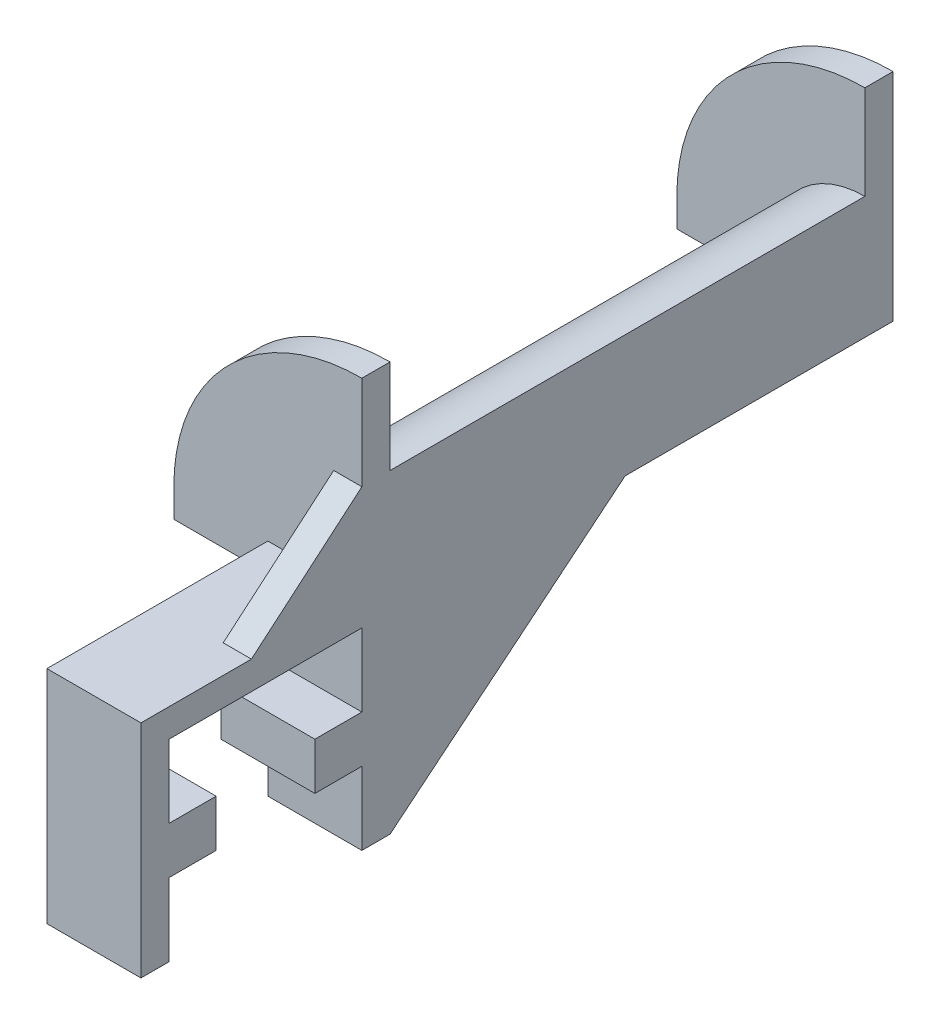
ISO-10303-21;
HEADER;
FILE_DESCRIPTION(('STEP AP214'),'2;1');
FILE_NAME('part.step','',(''),(''),'','','');
FILE_SCHEMA(('AUTOMOTIVE_DESIGN { 1 0 10303 214 1 1 1 1 }'));
ENDSEC;
DATA;
#1=APPLICATION_CONTEXT('core data for automotive mechanical design processes');
#2=APPLICATION_PROTOCOL_DEFINITION('international standard','automotive_design',2000,#1);
#3=PRODUCT_CONTEXT('',#1,'mechanical');
#4=PRODUCT('Part','Part','',(#3));
#5=PRODUCT_RELATED_PRODUCT_CATEGORY('part','',(#4));
#6=PRODUCT_DEFINITION_FORMATION('','',#4);
#7=PRODUCT_DEFINITION_CONTEXT('part definition',#1,'design');
#8=PRODUCT_DEFINITION('design','',#6,#7);
#9=PRODUCT_DEFINITION_SHAPE('','',#8);
#10=(LENGTH_UNIT() NAMED_UNIT(*) SI_UNIT(.MILLI.,.METRE.));
#11=(NAMED_UNIT(*) PLANE_ANGLE_UNIT() SI_UNIT($,.RADIAN.));
#12=(NAMED_UNIT(*) SI_UNIT($,.STERADIAN.) SOLID_ANGLE_UNIT());
#13=UNCERTAINTY_MEASURE_WITH_UNIT(LENGTH_MEASURE(1.E-05),#10,'distance_accuracy_value','');
#14=(GEOMETRIC_REPRESENTATION_CONTEXT(3) GLOBAL_UNCERTAINTY_ASSIGNED_CONTEXT((#13)) GLOBAL_UNIT_ASSIGNED_CONTEXT((#10,
#11,#12)) REPRESENTATION_CONTEXT('',''));
#15=CARTESIAN_POINT('',(0.,0.,0.));
#16=DIRECTION('',(0.,0.,1.));
#17=DIRECTION('',(1.,0.,0.));
#18=AXIS2_PLACEMENT_3D('',#15,#16,#17);
#19=CARTESIAN_POINT('',(10.,-3.,-23.5));
#20=DIRECTION('',(0.,0.,-1.));
#21=DIRECTION('',(0.,1.,0.));
#22=AXIS2_PLACEMENT_3D('',#19,#20,#21);
#23=PLANE('',#22);
#24=DIRECTION('',(0.,-1.,0.));
#25=VECTOR('',#24,1.);
#26=CARTESIAN_POINT('',(10.,-3.,-23.5));
#27=LINE('',#26,#25);
#28=CARTESIAN_POINT('',(10.,-15.75,-23.5));
#29=VERTEX_POINT('',#28);
#30=CARTESIAN_POINT('',(10.,-23.5,-23.5));
#31=VERTEX_POINT('',#30);
#32=EDGE_CURVE('E254',#29,#31,#27,.T.);
#33=ORIENTED_EDGE('',*,*,#32,.F.);
#34=DIRECTION('',(1.,0.,0.));
#35=VECTOR('',#34,1.);
#36=CARTESIAN_POINT('',(-7.07106781186548,-15.75,-23.5));
#37=LINE('',#36,#35);
#38=CARTESIAN_POINT('',(0.,-15.75,-23.5));
#39=VERTEX_POINT('',#38);
#40=EDGE_CURVE('E468',#39,#29,#37,.T.);
#41=ORIENTED_EDGE('',*,*,#40,.F.);
#42=DIRECTION('',(0.,-1.,0.));
#43=VECTOR('',#42,1.);
#44=CARTESIAN_POINT('',(0.,-3.,-23.5));
#45=LINE('',#44,#43);
#46=CARTESIAN_POINT('',(0.,-23.5,-23.5));
#47=VERTEX_POINT('',#46);
#48=EDGE_CURVE('E281',#39,#47,#45,.T.);
#49=ORIENTED_EDGE('',*,*,#48,.T.);
#50=DIRECTION('',(-1.,0.,0.));
#51=VECTOR('',#50,1.);
#52=CARTESIAN_POINT('',(10.,-23.5,-23.5));
#53=LINE('',#52,#51);
#54=EDGE_CURVE('E299',#31,#47,#53,.T.);
#55=ORIENTED_EDGE('',*,*,#54,.F.);
#56=EDGE_LOOP('',(#33,#41,#49,#55));
#57=FACE_BOUND('',#56,.T.);
#58=ADVANCED_FACE('F33',(#57),#23,.F.);
#59=CARTESIAN_POINT('',(10.,-23.5,-3.));
#60=DIRECTION('',(0.,0.,1.));
#61=DIRECTION('',(0.,-1.,0.));
#62=AXIS2_PLACEMENT_3D('',#59,#60,#61);
#63=PLANE('',#62);
#64=DIRECTION('',(0.,1.,0.));
#65=VECTOR('',#64,1.);
#66=CARTESIAN_POINT('',(10.,-23.5,-3.));
#67=LINE('',#66,#65);
#68=CARTESIAN_POINT('',(10.,-10.75,-3.00000000000001));
#69=VERTEX_POINT('',#68);
#70=CARTESIAN_POINT('',(10.,-3.,-3.00000000000001));
#71=VERTEX_POINT('',#70);
#72=EDGE_CURVE('E336',#69,#71,#67,.T.);
#73=ORIENTED_EDGE('',*,*,#72,.F.);
#74=DIRECTION('',(1.,0.,0.));
#75=VECTOR('',#74,1.);
#76=CARTESIAN_POINT('',(-7.07106781186548,-10.75,-3.));
#77=LINE('',#76,#75);
#78=CARTESIAN_POINT('',(0.,-10.75,-3.));
#79=VERTEX_POINT('',#78);
#80=EDGE_CURVE('E452',#79,#69,#77,.T.);
#81=ORIENTED_EDGE('',*,*,#80,.F.);
#82=DIRECTION('',(0.,1.,0.));
#83=VECTOR('',#82,1.);
#84=CARTESIAN_POINT('',(0.,-23.5,-3.));
#85=LINE('',#84,#83);
#86=CARTESIAN_POINT('',(0.,-3.,-3.00000000000001));
#87=VERTEX_POINT('',#86);
#88=EDGE_CURVE('E274',#79,#87,#85,.T.);
#89=ORIENTED_EDGE('',*,*,#88,.T.);
#90=DIRECTION('',(-1.,0.,0.));
#91=VECTOR('',#90,1.);
#92=CARTESIAN_POINT('',(10.,-3.,-3.00000000000001));
#93=LINE('',#92,#91);
#94=EDGE_CURVE('E304',#71,#87,#93,.T.);
#95=ORIENTED_EDGE('',*,*,#94,.F.);
#96=EDGE_LOOP('',(#73,#81,#89,#95));
#97=FACE_BOUND('',#96,.T.);
#98=ADVANCED_FACE('F550',(#97),#63,.F.);
#99=CARTESIAN_POINT('',(0.,0.,0.));
#100=DIRECTION('',(1.,0.,0.));
#101=DIRECTION('',(0.,0.,-1.));
#102=AXIS2_PLACEMENT_3D('',#99,#100,#101);
#103=PLANE('',#102);
#104=DIRECTION('',(0.,0.,1.));
#105=VECTOR('',#104,1.);
#106=CARTESIAN_POINT('',(0.,-3.,0.));
#107=LINE('',#106,#105);
#108=CARTESIAN_POINT('',(0.,-3.,-26.5));
#109=VERTEX_POINT('',#108);
#110=CARTESIAN_POINT('',(0.,-3.,-23.5));
#111=VERTEX_POINT('',#110);
#112=EDGE_CURVE('E360',#109,#111,#107,.T.);
#113=ORIENTED_EDGE('',*,*,#112,.F.);
#114=DIRECTION('',(0.,1.,0.));
#115=VECTOR('',#114,1.);
#116=CARTESIAN_POINT('',(0.,-23.5,-26.5));
#117=LINE('',#116,#115);
#118=CARTESIAN_POINT('',(0.,-23.5,-26.5));
#119=VERTEX_POINT('',#118);
#120=EDGE_CURVE('E286',#119,#109,#117,.T.);
#121=ORIENTED_EDGE('',*,*,#120,.F.);
#122=DIRECTION('',(0.,0.,-1.));
#123=VECTOR('',#122,1.);
#124=CARTESIAN_POINT('',(0.,-23.5,-23.5));
#125=LINE('',#124,#123);
#126=EDGE_CURVE('E283',#47,#119,#125,.T.);
#127=ORIENTED_EDGE('',*,*,#126,.F.);
#128=ORIENTED_EDGE('',*,*,#48,.F.);
#129=DIRECTION('',(0.,0.,1.));
#130=VECTOR('',#129,1.);
#131=CARTESIAN_POINT('',(0.,-15.75,-23.5));
#132=LINE('',#131,#130);
#133=CARTESIAN_POINT('',(0.,-15.75,-18.5));
#134=VERTEX_POINT('',#133);
#135=EDGE_CURVE('E463',#39,#134,#132,.T.);
#136=ORIENTED_EDGE('',*,*,#135,.T.);
#137=DIRECTION('',(0.,1.,0.));
#138=VECTOR('',#137,1.);
#139=CARTESIAN_POINT('',(0.,-10.75,-18.5));
#140=LINE('',#139,#138);
#141=CARTESIAN_POINT('',(0.,-10.75,-18.5));
#142=VERTEX_POINT('',#141);
#143=EDGE_CURVE('E470',#134,#142,#140,.T.);
#144=ORIENTED_EDGE('',*,*,#143,.T.);
#145=DIRECTION('',(0.,0.,-1.));
#146=VECTOR('',#145,1.);
#147=CARTESIAN_POINT('',(0.,-10.75,-23.5));
#148=LINE('',#147,#146);
#149=CARTESIAN_POINT('',(0.,-10.75,-23.5));
#150=VERTEX_POINT('',#149);
#151=EDGE_CURVE('E460',#142,#150,#148,.T.);
#152=ORIENTED_EDGE('',*,*,#151,.T.);
#153=EDGE_CURVE('E246',#111,#150,#45,.T.);
#154=ORIENTED_EDGE('',*,*,#153,.F.);
#155=EDGE_LOOP('',(#113,#121,#127,#128,#136,#144,#152,#154));
#156=FACE_BOUND('',#155,.T.);
#157=ADVANCED_FACE('F477',(#156),#103,.F.);
#158=DIRECTION('',(0.,1.,0.));
#159=VECTOR('',#158,1.);
#160=CARTESIAN_POINT('',(0.,0.,-23.5));
#161=LINE('',#160,#159);
#162=CARTESIAN_POINT('',(0.,0.,-23.5));
#163=VERTEX_POINT('',#162);
#164=EDGE_CURVE('E376',#111,#163,#161,.T.);
#165=ORIENTED_EDGE('',*,*,#164,.F.);
#166=DIRECTION('',(0.,0.,-1.));
#167=VECTOR('',#166,1.);
#168=CARTESIAN_POINT('',(0.,-3.,-3.00000000000001));
#169=LINE('',#168,#167);
#170=EDGE_CURVE('E278',#87,#111,#169,.T.);
#171=ORIENTED_EDGE('',*,*,#170,.F.);
#172=ORIENTED_EDGE('',*,*,#88,.F.);
#173=DIRECTION('',(0.,0.,-1.));
#174=VECTOR('',#173,1.);
#175=CARTESIAN_POINT('',(0.,-10.75,-3.));
#176=LINE('',#175,#174);
#177=CARTESIAN_POINT('',(0.,-10.75,-8.));
#178=VERTEX_POINT('',#177);
#179=EDGE_CURVE('E446',#79,#178,#176,.T.);
#180=ORIENTED_EDGE('',*,*,#179,.T.);
#181=DIRECTION('',(0.,-1.,0.));
#182=VECTOR('',#181,1.);
#183=CARTESIAN_POINT('',(0.,-10.75,-8.));
#184=LINE('',#183,#182);
#185=CARTESIAN_POINT('',(0.,-15.75,-8.));
#186=VERTEX_POINT('',#185);
#187=EDGE_CURVE('E454',#178,#186,#184,.T.);
#188=ORIENTED_EDGE('',*,*,#187,.T.);
#189=DIRECTION('',(0.,0.,1.));
#190=VECTOR('',#189,1.);
#191=CARTESIAN_POINT('',(0.,-15.75,-3.));
#192=LINE('',#191,#190);
#193=CARTESIAN_POINT('',(0.,-15.75,-3.));
#194=VERTEX_POINT('',#193);
#195=EDGE_CURVE('E326',#186,#194,#192,.T.);
#196=ORIENTED_EDGE('',*,*,#195,.T.);
#197=CARTESIAN_POINT('',(0.,-23.5,-3.));
#198=VERTEX_POINT('',#197);
#199=EDGE_CURVE('E275',#198,#194,#85,.T.);
#200=ORIENTED_EDGE('',*,*,#199,.F.);
#201=DIRECTION('',(0.,0.,-1.));
#202=VECTOR('',#201,1.);
#203=CARTESIAN_POINT('',(0.,-23.5,0.));
#204=LINE('',#203,#202);
#205=CARTESIAN_POINT('',(0.,-23.5,0.));
#206=VERTEX_POINT('',#205);
#207=EDGE_CURVE('E272',#206,#198,#204,.T.);
#208=ORIENTED_EDGE('',*,*,#207,.F.);
#209=DIRECTION('',(0.,-1.,0.));
#210=VECTOR('',#209,1.);
#211=CARTESIAN_POINT('',(0.,0.,0.));
#212=LINE('',#211,#210);
#213=CARTESIAN_POINT('',(0.,0.,0.));
#214=VERTEX_POINT('',#213);
#215=EDGE_CURVE('E269',#214,#206,#212,.T.);
#216=ORIENTED_EDGE('',*,*,#215,.F.);
#217=DIRECTION('',(0.,0.,1.));
#218=VECTOR('',#217,1.);
#219=CARTESIAN_POINT('',(0.,0.,-80.));
#220=LINE('',#219,#218);
#221=EDGE_CURVE('E270',#163,#214,#220,.T.);
#222=ORIENTED_EDGE('',*,*,#221,.F.);
#223=EDGE_LOOP('',(#165,#171,#172,#180,#188,#196,#200,#208,#216,#222));
#224=FACE_BOUND('',#223,.T.);
#225=ADVANCED_FACE('F323',(#224),#103,.F.);
#226=DIRECTION('',(0.,0.,-1.));
#227=VECTOR('',#226,1.);
#228=CARTESIAN_POINT('',(0.,-3.,-26.5));
#229=LINE('',#228,#227);
#230=CARTESIAN_POINT('',(0.,-3.,-77.));
#231=VERTEX_POINT('',#230);
#232=EDGE_CURVE('E289',#109,#231,#229,.T.);
#233=ORIENTED_EDGE('',*,*,#232,.F.);
#234=DIRECTION('',(0.,1.,0.));
#235=VECTOR('',#234,1.);
#236=CARTESIAN_POINT('',(0.,0.,-26.5));
#237=LINE('',#236,#235);
#238=CARTESIAN_POINT('',(0.,0.,-26.5));
#239=VERTEX_POINT('',#238);
#240=EDGE_CURVE('E371',#109,#239,#237,.T.);
#241=ORIENTED_EDGE('',*,*,#240,.T.);
#242=CARTESIAN_POINT('',(0.,0.,-77.));
#243=VERTEX_POINT('',#242);
#244=EDGE_CURVE('E266',#243,#239,#220,.T.);
#245=ORIENTED_EDGE('',*,*,#244,.F.);
#246=DIRECTION('',(0.,1.,0.));
#247=VECTOR('',#246,1.);
#248=CARTESIAN_POINT('',(0.,0.,-77.));
#249=LINE('',#248,#247);
#250=EDGE_CURVE('E342',#231,#243,#249,.T.);
#251=ORIENTED_EDGE('',*,*,#250,.F.);
#252=EDGE_LOOP('',(#233,#241,#245,#251));
#253=FACE_BOUND('',#252,.T.);
#254=ADVANCED_FACE('F539',(#253),#103,.F.);
#255=CARTESIAN_POINT('',(10.,0.,14.142135623731));
#256=DIRECTION('',(0.,0.,-1.));
#257=DIRECTION('',(-1.,0.,0.));
#258=AXIS2_PLACEMENT_3D('',#255,#256,#257);
#259=CYLINDRICAL_SURFACE('',#258,10.);
#260=CARTESIAN_POINT('',(10.,0.,-26.5));
#261=DIRECTION('',(0.,0.,-1.));
#262=DIRECTION('',(0.,1.,0.));
#263=AXIS2_PLACEMENT_3D('',#260,#261,#262);
#264=CIRCLE('',#263,10.);
#265=CARTESIAN_POINT('',(10.,10.,-26.5));
#266=VERTEX_POINT('',#265);
#267=EDGE_CURVE('E374',#266,#239,#264,.F.);
#268=ORIENTED_EDGE('',*,*,#267,.F.);
#269=DIRECTION('',(0.,0.,-1.));
#270=VECTOR('',#269,1.);
#271=CARTESIAN_POINT('',(10.,10.,14.142135623731));
#272=LINE('',#271,#270);
#273=CARTESIAN_POINT('',(10.,10.,-77.));
#274=VERTEX_POINT('',#273);
#275=EDGE_CURVE('E340',#266,#274,#272,.T.);
#276=ORIENTED_EDGE('',*,*,#275,.T.);
#277=CARTESIAN_POINT('',(10.,0.,-77.));
#278=DIRECTION('',(0.,0.,-1.));
#279=DIRECTION('',(-1.,0.,0.));
#280=AXIS2_PLACEMENT_3D('',#277,#278,#279);
#281=CIRCLE('',#280,10.);
#282=EDGE_CURVE('E11',#274,#243,#281,.F.);
#283=ORIENTED_EDGE('',*,*,#282,.T.);
#284=ORIENTED_EDGE('',*,*,#244,.T.);
#285=EDGE_LOOP('',(#268,#276,#283,#284));
#286=FACE_BOUND('',#285,.T.);
#287=ADVANCED_FACE('F533',(#286),#259,.T.);
#288=CARTESIAN_POINT('',(10.,0.,0.));
#289=DIRECTION('',(0.,0.,-1.));
#290=DIRECTION('',(0.,1.,0.));
#291=AXIS2_PLACEMENT_3D('',#288,#289,#290);
#292=PLANE('',#291);
#293=DIRECTION('',(0.,-1.,0.));
#294=VECTOR('',#293,1.);
#295=CARTESIAN_POINT('',(10.,0.,0.));
#296=LINE('',#295,#294);
#297=CARTESIAN_POINT('',(10.,0.,0.));
#298=VERTEX_POINT('',#297);
#299=CARTESIAN_POINT('',(10.,-23.5,0.));
#300=VERTEX_POINT('',#299);
#301=EDGE_CURVE('E292',#298,#300,#296,.T.);
#302=ORIENTED_EDGE('',*,*,#301,.F.);
#303=DIRECTION('',(1.,0.,0.));
#304=VECTOR('',#303,1.);
#305=CARTESIAN_POINT('',(0.,0.,0.));
#306=LINE('',#305,#304);
#307=EDGE_CURVE('E425',#214,#298,#306,.T.);
#308=ORIENTED_EDGE('',*,*,#307,.F.);
#309=ORIENTED_EDGE('',*,*,#215,.T.);
#310=DIRECTION('',(-1.,0.,0.));
#311=VECTOR('',#310,1.);
#312=CARTESIAN_POINT('',(10.,-23.5,0.));
#313=LINE('',#312,#311);
#314=EDGE_CURVE('E41',#300,#206,#313,.T.);
#315=ORIENTED_EDGE('',*,*,#314,.F.);
#316=EDGE_LOOP('',(#302,#308,#309,#315));
#317=FACE_BOUND('',#316,.T.);
#318=ADVANCED_FACE('F35',(#317),#292,.F.);
#319=CARTESIAN_POINT('',(10.,-23.5,0.));
#320=DIRECTION('',(0.,1.,0.));
#321=DIRECTION('',(0.,0.,1.));
#322=AXIS2_PLACEMENT_3D('',#319,#320,#321);
#323=PLANE('',#322);
#324=ORIENTED_EDGE('',*,*,#207,.T.);
#325=DIRECTION('',(-1.,0.,0.));
#326=VECTOR('',#325,1.);
#327=CARTESIAN_POINT('',(10.,-23.5,-3.));
#328=LINE('',#327,#326);
#329=CARTESIAN_POINT('',(10.,-23.5,-3.));
#330=VERTEX_POINT('',#329);
#331=EDGE_CURVE('E307',#330,#198,#328,.T.);
#332=ORIENTED_EDGE('',*,*,#331,.F.);
#333=DIRECTION('',(0.,0.,-1.));
#334=VECTOR('',#333,1.);
#335=CARTESIAN_POINT('',(10.,-23.5,0.));
#336=LINE('',#335,#334);
#337=EDGE_CURVE('E316',#300,#330,#336,.T.);
#338=ORIENTED_EDGE('',*,*,#337,.F.);
#339=ORIENTED_EDGE('',*,*,#314,.T.);
#340=EDGE_LOOP('',(#324,#332,#338,#339));
#341=FACE_BOUND('',#340,.T.);
#342=ADVANCED_FACE('F314',(#341),#323,.F.);
#343=ORIENTED_EDGE('',*,*,#199,.T.);
#344=DIRECTION('',(1.,0.,0.));
#345=VECTOR('',#344,1.);
#346=CARTESIAN_POINT('',(-7.07106781186548,-15.75,-3.));
#347=LINE('',#346,#345);
#348=CARTESIAN_POINT('',(10.,-15.75,-3.));
#349=VERTEX_POINT('',#348);
#350=EDGE_CURVE('E332',#194,#349,#347,.T.);
#351=ORIENTED_EDGE('',*,*,#350,.T.);
#352=EDGE_CURVE('E334',#330,#349,#67,.T.);
#353=ORIENTED_EDGE('',*,*,#352,.F.);
#354=ORIENTED_EDGE('',*,*,#331,.T.);
#355=EDGE_LOOP('',(#343,#351,#353,#354));
#356=FACE_BOUND('',#355,.T.);
#357=ADVANCED_FACE('F330',(#356),#63,.F.);
#358=CARTESIAN_POINT('',(10.,-3.,-3.00000000000001));
#359=DIRECTION('',(0.,1.,0.));
#360=DIRECTION('',(0.,0.,1.));
#361=AXIS2_PLACEMENT_3D('',#358,#359,#360);
#362=PLANE('',#361);
#363=ORIENTED_EDGE('',*,*,#170,.T.);
#364=DIRECTION('',(-1.,0.,0.));
#365=VECTOR('',#364,1.);
#366=CARTESIAN_POINT('',(10.,-3.,-23.5));
#367=LINE('',#366,#365);
#368=CARTESIAN_POINT('',(10.,-3.,-23.5));
#369=VERTEX_POINT('',#368);
#370=EDGE_CURVE('E302',#369,#111,#367,.T.);
#371=ORIENTED_EDGE('',*,*,#370,.F.);
#372=DIRECTION('',(0.,0.,-1.));
#373=VECTOR('',#372,1.);
#374=CARTESIAN_POINT('',(10.,-3.,-3.00000000000001));
#375=LINE('',#374,#373);
#376=EDGE_CURVE('E251',#71,#369,#375,.T.);
#377=ORIENTED_EDGE('',*,*,#376,.F.);
#378=ORIENTED_EDGE('',*,*,#94,.T.);
#379=EDGE_LOOP('',(#363,#371,#377,#378));
#380=FACE_BOUND('',#379,.T.);
#381=ADVANCED_FACE('F561',(#380),#362,.F.);
#382=ORIENTED_EDGE('',*,*,#153,.T.);
#383=DIRECTION('',(1.,0.,0.));
#384=VECTOR('',#383,1.);
#385=CARTESIAN_POINT('',(-7.07106781186548,-10.75,-23.5));
#386=LINE('',#385,#384);
#387=CARTESIAN_POINT('',(10.,-10.75,-23.5));
#388=VERTEX_POINT('',#387);
#389=EDGE_CURVE('E232',#150,#388,#386,.T.);
#390=ORIENTED_EDGE('',*,*,#389,.T.);
#391=EDGE_CURVE('E244',#369,#388,#27,.T.);
#392=ORIENTED_EDGE('',*,*,#391,.F.);
#393=ORIENTED_EDGE('',*,*,#370,.T.);
#394=EDGE_LOOP('',(#382,#390,#392,#393));
#395=FACE_BOUND('',#394,.T.);
#396=ADVANCED_FACE('F242',(#395),#23,.F.);
#397=CARTESIAN_POINT('',(10.,-23.5,-23.5));
#398=DIRECTION('',(0.,1.,0.));
#399=DIRECTION('',(0.,0.,1.));
#400=AXIS2_PLACEMENT_3D('',#397,#398,#399);
#401=PLANE('',#400);
#402=ORIENTED_EDGE('',*,*,#126,.T.);
#403=DIRECTION('',(-1.,0.,0.));
#404=VECTOR('',#403,1.);
#405=CARTESIAN_POINT('',(10.,-23.5,-26.5));
#406=LINE('',#405,#404);
#407=CARTESIAN_POINT('',(7.,-23.5,-26.5));
#408=VERTEX_POINT('',#407);
#409=EDGE_CURVE('E296',#408,#119,#406,.T.);
#410=ORIENTED_EDGE('',*,*,#409,.F.);
#411=CARTESIAN_POINT('',(10.,-23.5,-26.5));
#412=VERTEX_POINT('',#411);
#413=EDGE_CURVE('E297',#412,#408,#406,.T.);
#414=ORIENTED_EDGE('',*,*,#413,.F.);
#415=DIRECTION('',(0.,0.,-1.));
#416=VECTOR('',#415,1.);
#417=CARTESIAN_POINT('',(10.,-23.5,-23.5));
#418=LINE('',#417,#416);
#419=EDGE_CURVE('E253',#31,#412,#418,.T.);
#420=ORIENTED_EDGE('',*,*,#419,.F.);
#421=ORIENTED_EDGE('',*,*,#54,.T.);
#422=EDGE_LOOP('',(#402,#410,#414,#420,#421));
#423=FACE_BOUND('',#422,.T.);
#424=ADVANCED_FACE('F492',(#423),#401,.F.);
#425=CARTESIAN_POINT('',(10.,-23.5,-26.5));
#426=DIRECTION('',(0.,0.,1.));
#427=DIRECTION('',(1.,0.,0.));
#428=AXIS2_PLACEMENT_3D('',#425,#426,#427);
#429=PLANE('',#428);
#430=DIRECTION('',(-1.,0.,0.));
#431=VECTOR('',#430,1.);
#432=CARTESIAN_POINT('',(10.,-3.,-26.5));
#433=LINE('',#432,#431);
#434=CARTESIAN_POINT('',(7.,-3.,-26.5));
#435=VERTEX_POINT('',#434);
#436=EDGE_CURVE('E294',#435,#109,#433,.T.);
#437=ORIENTED_EDGE('',*,*,#436,.F.);
#438=DIRECTION('',(0.,-1.,0.));
#439=VECTOR('',#438,1.);
#440=CARTESIAN_POINT('',(7.,-23.5,-26.5));
#441=LINE('',#440,#439);
#442=EDGE_CURVE('E409',#435,#408,#441,.T.);
#443=ORIENTED_EDGE('',*,*,#442,.T.);
#444=ORIENTED_EDGE('',*,*,#409,.T.);
#445=ORIENTED_EDGE('',*,*,#120,.T.);
#446=EDGE_LOOP('',(#437,#443,#444,#445));
#447=FACE_BOUND('',#446,.T.);
#448=ADVANCED_FACE('F501',(#447),#429,.F.);
#449=CARTESIAN_POINT('',(10.,-3.,-26.5));
#450=DIRECTION('',(0.,1.,0.));
#451=DIRECTION('',(0.,0.,1.));
#452=AXIS2_PLACEMENT_3D('',#449,#450,#451);
#453=PLANE('',#452);
#454=DIRECTION('',(0.,0.,-1.));
#455=VECTOR('',#454,1.);
#456=CARTESIAN_POINT('',(10.,-3.,-26.5));
#457=LINE('',#456,#455);
#458=CARTESIAN_POINT('',(10.,-3.,-51.5));
#459=VERTEX_POINT('',#458);
#460=CARTESIAN_POINT('',(10.,-3.,-80.));
#461=VERTEX_POINT('',#460);
#462=EDGE_CURVE('E257',#459,#461,#457,.T.);
#463=ORIENTED_EDGE('',*,*,#462,.F.);
#464=DIRECTION('',(1.,0.,0.));
#465=VECTOR('',#464,1.);
#466=CARTESIAN_POINT('',(7.,-3.,-51.5));
#467=LINE('',#466,#465);
#468=CARTESIAN_POINT('',(7.,-3.,-51.5));
#469=VERTEX_POINT('',#468);
#470=EDGE_CURVE('E399',#469,#459,#467,.T.);
#471=ORIENTED_EDGE('',*,*,#470,.F.);
#472=DIRECTION('',(0.,0.,1.));
#473=VECTOR('',#472,1.);
#474=CARTESIAN_POINT('',(7.,-3.,-26.5));
#475=LINE('',#474,#473);
#476=EDGE_CURVE('E416',#469,#435,#475,.T.);
#477=ORIENTED_EDGE('',*,*,#476,.T.);
#478=ORIENTED_EDGE('',*,*,#436,.T.);
#479=ORIENTED_EDGE('',*,*,#232,.T.);
#480=DIRECTION('',(-1.,0.,0.));
#481=VECTOR('',#480,1.);
#482=CARTESIAN_POINT('',(10.,-3.,-77.));
#483=LINE('',#482,#481);
#484=CARTESIAN_POINT('',(-10.,-3.,-77.));
#485=VERTEX_POINT('',#484);
#486=EDGE_CURVE('E356',#231,#485,#483,.T.);
#487=ORIENTED_EDGE('',*,*,#486,.T.);
#488=DIRECTION('',(0.,0.,-1.));
#489=VECTOR('',#488,1.);
#490=CARTESIAN_POINT('',(-10.,-3.,-77.));
#491=LINE('',#490,#489);
#492=CARTESIAN_POINT('',(-10.,-3.,-80.));
#493=VERTEX_POINT('',#492);
#494=EDGE_CURVE('E345',#485,#493,#491,.T.);
#495=ORIENTED_EDGE('',*,*,#494,.T.);
#496=DIRECTION('',(-1.,0.,0.));
#497=VECTOR('',#496,1.);
#498=CARTESIAN_POINT('',(10.,-3.,-80.));
#499=LINE('',#498,#497);
#500=EDGE_CURVE('E265',#461,#493,#499,.T.);
#501=ORIENTED_EDGE('',*,*,#500,.F.);
#502=EDGE_LOOP('',(#463,#471,#477,#478,#479,#487,#495,#501));
#503=FACE_BOUND('',#502,.T.);
#504=ADVANCED_FACE('F507',(#503),#453,.F.);
#505=CARTESIAN_POINT('',(10.,-3.,-80.));
#506=DIRECTION('',(0.,0.,1.));
#507=DIRECTION('',(1.,0.,0.));
#508=AXIS2_PLACEMENT_3D('',#505,#506,#507);
#509=PLANE('',#508);
#510=ORIENTED_EDGE('',*,*,#500,.T.);
#511=DIRECTION('',(0.,1.,0.));
#512=VECTOR('',#511,1.);
#513=CARTESIAN_POINT('',(-10.,-3.,-80.));
#514=LINE('',#513,#512);
#515=CARTESIAN_POINT('',(-10.,0.,-80.));
#516=VERTEX_POINT('',#515);
#517=EDGE_CURVE('E357',#493,#516,#514,.T.);
#518=ORIENTED_EDGE('',*,*,#517,.T.);
#519=CARTESIAN_POINT('',(10.,0.,-80.));
#520=DIRECTION('',(0.,0.,-1.));
#521=DIRECTION('',(-1.,0.,0.));
#522=AXIS2_PLACEMENT_3D('',#519,#520,#521);
#523=CIRCLE('',#522,20.);
#524=CARTESIAN_POINT('',(10.,20.,-80.));
#525=VERTEX_POINT('',#524);
#526=EDGE_CURVE('E353',#516,#525,#523,.T.);
#527=ORIENTED_EDGE('',*,*,#526,.T.);
#528=DIRECTION('',(0.,1.,0.));
#529=VECTOR('',#528,1.);
#530=CARTESIAN_POINT('',(10.,-3.,-80.));
#531=LINE('',#530,#529);
#532=EDGE_CURVE('E263',#461,#525,#531,.T.);
#533=ORIENTED_EDGE('',*,*,#532,.F.);
#534=EDGE_LOOP('',(#510,#518,#527,#533));
#535=FACE_BOUND('',#534,.T.);
#536=ADVANCED_FACE('F643',(#535),#509,.F.);
#537=CARTESIAN_POINT('',(10.,0.,0.));
#538=DIRECTION('',(1.,0.,0.));
#539=DIRECTION('',(0.,0.,-1.));
#540=AXIS2_PLACEMENT_3D('',#537,#538,#539);
#541=PLANE('',#540);
#542=DIRECTION('',(0.,-1.,0.));
#543=VECTOR('',#542,1.);
#544=CARTESIAN_POINT('',(10.,-3.,-23.5));
#545=LINE('',#544,#543);
#546=CARTESIAN_POINT('',(10.,20.,-23.5));
#547=VERTEX_POINT('',#546);
#548=CARTESIAN_POINT('',(10.,10.,-23.5));
#549=VERTEX_POINT('',#548);
#550=EDGE_CURVE('E394',#547,#549,#545,.T.);
#551=ORIENTED_EDGE('',*,*,#550,.T.);
#552=DIRECTION('',(0.,-0.648118629528358,0.761539389695821));
#553=VECTOR('',#552,1.);
#554=CARTESIAN_POINT('',(10.,10.,-23.5));
#555=LINE('',#554,#553);
#556=CARTESIAN_POINT('',(10.,0.,-11.75));
#557=VERTEX_POINT('',#556);
#558=EDGE_CURVE('E435',#549,#557,#555,.T.);
#559=ORIENTED_EDGE('',*,*,#558,.T.);
#560=DIRECTION('',(0.,0.,1.));
#561=VECTOR('',#560,1.);
#562=CARTESIAN_POINT('',(10.,0.,-37.642135623731));
#563=LINE('',#562,#561);
#564=EDGE_CURVE('E413',#557,#298,#563,.T.);
#565=ORIENTED_EDGE('',*,*,#564,.T.);
#566=ORIENTED_EDGE('',*,*,#301,.T.);
#567=ORIENTED_EDGE('',*,*,#337,.T.);
#568=ORIENTED_EDGE('',*,*,#352,.T.);
#569=DIRECTION('',(0.,0.,-1.));
#570=VECTOR('',#569,1.);
#571=CARTESIAN_POINT('',(10.,-15.75,-3.));
#572=LINE('',#571,#570);
#573=CARTESIAN_POINT('',(10.,-15.75,-8.));
#574=VERTEX_POINT('',#573);
#575=EDGE_CURVE('E458',#349,#574,#572,.T.);
#576=ORIENTED_EDGE('',*,*,#575,.T.);
#577=DIRECTION('',(0.,1.,0.));
#578=VECTOR('',#577,1.);
#579=CARTESIAN_POINT('',(10.,-10.75,-8.));
#580=LINE('',#579,#578);
#581=CARTESIAN_POINT('',(10.,-10.75,-8.));
#582=VERTEX_POINT('',#581);
#583=EDGE_CURVE('E456',#574,#582,#580,.T.);
#584=ORIENTED_EDGE('',*,*,#583,.T.);
#585=DIRECTION('',(0.,0.,1.));
#586=VECTOR('',#585,1.);
#587=CARTESIAN_POINT('',(10.,-10.75,-3.));
#588=LINE('',#587,#586);
#589=EDGE_CURVE('E55',#582,#69,#588,.T.);
#590=ORIENTED_EDGE('',*,*,#589,.T.);
#591=ORIENTED_EDGE('',*,*,#72,.T.);
#592=ORIENTED_EDGE('',*,*,#376,.T.);
#593=ORIENTED_EDGE('',*,*,#391,.T.);
#594=DIRECTION('',(0.,0.,1.));
#595=VECTOR('',#594,1.);
#596=CARTESIAN_POINT('',(10.,-10.75,-23.5));
#597=LINE('',#596,#595);
#598=CARTESIAN_POINT('',(10.,-10.75,-18.5));
#599=VERTEX_POINT('',#598);
#600=EDGE_CURVE('E228',#388,#599,#597,.T.);
#601=ORIENTED_EDGE('',*,*,#600,.T.);
#602=DIRECTION('',(0.,-1.,0.));
#603=VECTOR('',#602,1.);
#604=CARTESIAN_POINT('',(10.,-10.75,-18.5));
#605=LINE('',#604,#603);
#606=CARTESIAN_POINT('',(10.,-15.75,-18.5));
#607=VERTEX_POINT('',#606);
#608=EDGE_CURVE('E238',#599,#607,#605,.T.);
#609=ORIENTED_EDGE('',*,*,#608,.T.);
#610=DIRECTION('',(0.,0.,-1.));
#611=VECTOR('',#610,1.);
#612=CARTESIAN_POINT('',(10.,-15.75,-23.5));
#613=LINE('',#612,#611);
#614=EDGE_CURVE('E48',#607,#29,#613,.T.);
#615=ORIENTED_EDGE('',*,*,#614,.T.);
#616=ORIENTED_EDGE('',*,*,#32,.T.);
#617=ORIENTED_EDGE('',*,*,#419,.T.);
#618=DIRECTION('',(0.,0.634079588207047,-0.773267790496398));
#619=VECTOR('',#618,1.);
#620=CARTESIAN_POINT('',(10.,-3.,-51.5));
#621=LINE('',#620,#619);
#622=EDGE_CURVE('E410',#412,#459,#621,.T.);
#623=ORIENTED_EDGE('',*,*,#622,.T.);
#624=ORIENTED_EDGE('',*,*,#462,.T.);
#625=ORIENTED_EDGE('',*,*,#532,.T.);
#626=DIRECTION('',(0.,0.,-1.));
#627=VECTOR('',#626,1.);
#628=CARTESIAN_POINT('',(10.,20.,-77.));
#629=LINE('',#628,#627);
#630=CARTESIAN_POINT('',(10.,20.,-77.));
#631=VERTEX_POINT('',#630);
#632=EDGE_CURVE('E344',#631,#525,#629,.T.);
#633=ORIENTED_EDGE('',*,*,#632,.F.);
#634=DIRECTION('',(0.,-1.,0.));
#635=VECTOR('',#634,1.);
#636=CARTESIAN_POINT('',(10.,20.,-77.));
#637=LINE('',#636,#635);
#638=EDGE_CURVE('E349',#631,#274,#637,.T.);
#639=ORIENTED_EDGE('',*,*,#638,.T.);
#640=ORIENTED_EDGE('',*,*,#275,.F.);
#641=DIRECTION('',(0.,-1.,0.));
#642=VECTOR('',#641,1.);
#643=CARTESIAN_POINT('',(10.,-3.,-26.5));
#644=LINE('',#643,#642);
#645=CARTESIAN_POINT('',(10.,20.,-26.5));
#646=VERTEX_POINT('',#645);
#647=EDGE_CURVE('E403',#646,#266,#644,.T.);
#648=ORIENTED_EDGE('',*,*,#647,.F.);
#649=DIRECTION('',(0.,0.,1.));
#650=VECTOR('',#649,1.);
#651=CARTESIAN_POINT('',(10.,20.,-26.5));
#652=LINE('',#651,#650);
#653=EDGE_CURVE('E379',#646,#547,#652,.T.);
#654=ORIENTED_EDGE('',*,*,#653,.T.);
#655=EDGE_LOOP('',(#551,#559,#565,#566,#567,#568,#576,#584,#590,#591,#592,#593,#601,#609,#615,
#616,#617,#623,#624,#625,#633,#639,#640,#648,#654));
#656=FACE_BOUND('',#655,.T.);
#657=ADVANCED_FACE('F249',(#656),#541,.T.);
#658=CARTESIAN_POINT('',(10.,0.,-77.));
#659=DIRECTION('',(0.,0.,-1.));
#660=DIRECTION('',(-1.,0.,0.));
#661=AXIS2_PLACEMENT_3D('',#658,#659,#660);
#662=PLANE('',#661);
#663=ORIENTED_EDGE('',*,*,#486,.F.);
#664=ORIENTED_EDGE('',*,*,#250,.T.);
#665=ORIENTED_EDGE('',*,*,#282,.F.);
#666=ORIENTED_EDGE('',*,*,#638,.F.);
#667=CARTESIAN_POINT('',(10.,0.,-77.));
#668=DIRECTION('',(0.,0.,-1.));
#669=DIRECTION('',(-1.,0.,0.));
#670=AXIS2_PLACEMENT_3D('',#667,#668,#669);
#671=CIRCLE('',#670,20.);
#672=CARTESIAN_POINT('',(-10.,0.,-77.));
#673=VERTEX_POINT('',#672);
#674=EDGE_CURVE('E363',#673,#631,#671,.T.);
#675=ORIENTED_EDGE('',*,*,#674,.F.);
#676=DIRECTION('',(0.,1.,0.));
#677=VECTOR('',#676,1.);
#678=CARTESIAN_POINT('',(-10.,-3.,-77.));
#679=LINE('',#678,#677);
#680=EDGE_CURVE('E366',#485,#673,#679,.T.);
#681=ORIENTED_EDGE('',*,*,#680,.F.);
#682=EDGE_LOOP('',(#663,#664,#665,#666,#675,#681));
#683=FACE_BOUND('',#682,.T.);
#684=ADVANCED_FACE('F535',(#683),#662,.F.);
#685=CARTESIAN_POINT('',(10.,0.,-77.));
#686=DIRECTION('',(0.,0.,-1.));
#687=DIRECTION('',(-1.,0.,0.));
#688=AXIS2_PLACEMENT_3D('',#685,#686,#687);
#689=CYLINDRICAL_SURFACE('',#688,20.);
#690=ORIENTED_EDGE('',*,*,#526,.F.);
#691=DIRECTION('',(0.,0.,-1.));
#692=VECTOR('',#691,1.);
#693=CARTESIAN_POINT('',(-10.,0.,-77.));
#694=LINE('',#693,#692);
#695=EDGE_CURVE('E348',#673,#516,#694,.T.);
#696=ORIENTED_EDGE('',*,*,#695,.F.);
#697=ORIENTED_EDGE('',*,*,#674,.T.);
#698=ORIENTED_EDGE('',*,*,#632,.T.);
#699=EDGE_LOOP('',(#690,#696,#697,#698));
#700=FACE_BOUND('',#699,.T.);
#701=ADVANCED_FACE('F636',(#700),#689,.T.);
#702=CARTESIAN_POINT('',(-10.,-3.,-77.));
#703=DIRECTION('',(-1.,0.,0.));
#704=DIRECTION('',(0.,0.,1.));
#705=AXIS2_PLACEMENT_3D('',#702,#703,#704);
#706=PLANE('',#705);
#707=ORIENTED_EDGE('',*,*,#517,.F.);
#708=ORIENTED_EDGE('',*,*,#494,.F.);
#709=ORIENTED_EDGE('',*,*,#680,.T.);
#710=ORIENTED_EDGE('',*,*,#695,.T.);
#711=EDGE_LOOP('',(#707,#708,#709,#710));
#712=FACE_BOUND('',#711,.T.);
#713=ADVANCED_FACE('F631',(#712),#706,.T.);
#714=CARTESIAN_POINT('',(10.,-3.,-26.5));
#715=DIRECTION('',(0.,1.,0.));
#716=DIRECTION('',(0.,0.,1.));
#717=AXIS2_PLACEMENT_3D('',#714,#715,#716);
#718=PLANE('',#717);
#719=DIRECTION('',(-1.,0.,0.));
#720=VECTOR('',#719,1.);
#721=CARTESIAN_POINT('',(10.,-3.,-26.5));
#722=LINE('',#721,#720);
#723=CARTESIAN_POINT('',(-10.,-3.,-26.5));
#724=VERTEX_POINT('',#723);
#725=EDGE_CURVE('E401',#109,#724,#722,.T.);
#726=ORIENTED_EDGE('',*,*,#725,.F.);
#727=ORIENTED_EDGE('',*,*,#112,.T.);
#728=DIRECTION('',(-1.,0.,0.));
#729=VECTOR('',#728,1.);
#730=CARTESIAN_POINT('',(10.,-3.,-23.5));
#731=LINE('',#730,#729);
#732=CARTESIAN_POINT('',(-10.,-3.,-23.5));
#733=VERTEX_POINT('',#732);
#734=EDGE_CURVE('E392',#111,#733,#731,.T.);
#735=ORIENTED_EDGE('',*,*,#734,.T.);
#736=DIRECTION('',(0.,0.,1.));
#737=VECTOR('',#736,1.);
#738=CARTESIAN_POINT('',(-10.,-3.,-26.5));
#739=LINE('',#738,#737);
#740=EDGE_CURVE('E382',#724,#733,#739,.T.);
#741=ORIENTED_EDGE('',*,*,#740,.F.);
#742=EDGE_LOOP('',(#726,#727,#735,#741));
#743=FACE_BOUND('',#742,.T.);
#744=ADVANCED_FACE('F516',(#743),#718,.F.);
#745=CARTESIAN_POINT('',(10.,0.,-26.5));
#746=DIRECTION('',(0.,0.,-1.));
#747=DIRECTION('',(0.,1.,0.));
#748=AXIS2_PLACEMENT_3D('',#745,#746,#747);
#749=PLANE('',#748);
#750=ORIENTED_EDGE('',*,*,#240,.F.);
#751=ORIENTED_EDGE('',*,*,#725,.T.);
#752=DIRECTION('',(0.,1.,0.));
#753=VECTOR('',#752,1.);
#754=CARTESIAN_POINT('',(-10.,-3.,-26.5));
#755=LINE('',#754,#753);
#756=CARTESIAN_POINT('',(-10.,0.,-26.5));
#757=VERTEX_POINT('',#756);
#758=EDGE_CURVE('E388',#724,#757,#755,.T.);
#759=ORIENTED_EDGE('',*,*,#758,.T.);
#760=CARTESIAN_POINT('',(10.,0.,-26.5));
#761=DIRECTION('',(0.,0.,-1.));
#762=DIRECTION('',(0.,1.,0.));
#763=AXIS2_PLACEMENT_3D('',#760,#761,#762);
#764=CIRCLE('',#763,20.);
#765=EDGE_CURVE('E391',#757,#646,#764,.T.);
#766=ORIENTED_EDGE('',*,*,#765,.T.);
#767=ORIENTED_EDGE('',*,*,#647,.T.);
#768=ORIENTED_EDGE('',*,*,#267,.T.);
#769=EDGE_LOOP('',(#750,#751,#759,#766,#767,#768));
#770=FACE_BOUND('',#769,.T.);
#771=ADVANCED_FACE('F510',(#770),#749,.T.);
#772=CARTESIAN_POINT('',(10.,0.,-23.5));
#773=DIRECTION('',(0.,0.,-1.));
#774=DIRECTION('',(0.,1.,0.));
#775=AXIS2_PLACEMENT_3D('',#772,#773,#774);
#776=PLANE('',#775);
#777=DIRECTION('',(0.,1.,0.));
#778=VECTOR('',#777,1.);
#779=CARTESIAN_POINT('',(7.,0.,-23.5));
#780=LINE('',#779,#778);
#781=CARTESIAN_POINT('',(7.,0.,-23.5));
#782=VERTEX_POINT('',#781);
#783=CARTESIAN_POINT('',(7.,10.,-23.5));
#784=VERTEX_POINT('',#783);
#785=EDGE_CURVE('E440',#782,#784,#780,.T.);
#786=ORIENTED_EDGE('',*,*,#785,.T.);
#787=DIRECTION('',(1.,0.,0.));
#788=VECTOR('',#787,1.);
#789=CARTESIAN_POINT('',(7.,10.,-23.5));
#790=LINE('',#789,#788);
#791=EDGE_CURVE('E429',#784,#549,#790,.T.);
#792=ORIENTED_EDGE('',*,*,#791,.T.);
#793=ORIENTED_EDGE('',*,*,#550,.F.);
#794=CARTESIAN_POINT('',(10.,0.,-23.5));
#795=DIRECTION('',(0.,0.,-1.));
#796=DIRECTION('',(0.,1.,0.));
#797=AXIS2_PLACEMENT_3D('',#794,#795,#796);
#798=CIRCLE('',#797,20.);
#799=CARTESIAN_POINT('',(-10.,0.,-23.5));
#800=VERTEX_POINT('',#799);
#801=EDGE_CURVE('E396',#800,#547,#798,.T.);
#802=ORIENTED_EDGE('',*,*,#801,.F.);
#803=DIRECTION('',(0.,1.,0.));
#804=VECTOR('',#803,1.);
#805=CARTESIAN_POINT('',(-10.,-3.,-23.5));
#806=LINE('',#805,#804);
#807=EDGE_CURVE('E389',#733,#800,#806,.T.);
#808=ORIENTED_EDGE('',*,*,#807,.F.);
#809=ORIENTED_EDGE('',*,*,#734,.F.);
#810=ORIENTED_EDGE('',*,*,#164,.T.);
#811=DIRECTION('',(1.,0.,0.));
#812=VECTOR('',#811,1.);
#813=CARTESIAN_POINT('',(0.,0.,-23.5));
#814=LINE('',#813,#812);
#815=EDGE_CURVE('E422',#163,#782,#814,.T.);
#816=ORIENTED_EDGE('',*,*,#815,.T.);
#817=EDGE_LOOP('',(#786,#792,#793,#802,#808,#809,#810,#816));
#818=FACE_BOUND('',#817,.T.);
#819=ADVANCED_FACE('F624',(#818),#776,.F.);
#820=CARTESIAN_POINT('',(10.,0.,-26.5));
#821=DIRECTION('',(0.,0.,1.));
#822=DIRECTION('',(1.,0.,0.));
#823=AXIS2_PLACEMENT_3D('',#820,#821,#822);
#824=CYLINDRICAL_SURFACE('',#823,20.);
#825=ORIENTED_EDGE('',*,*,#801,.T.);
#826=ORIENTED_EDGE('',*,*,#653,.F.);
#827=ORIENTED_EDGE('',*,*,#765,.F.);
#828=DIRECTION('',(0.,0.,1.));
#829=VECTOR('',#828,1.);
#830=CARTESIAN_POINT('',(-10.,0.,-26.5));
#831=LINE('',#830,#829);
#832=EDGE_CURVE('E385',#757,#800,#831,.T.);
#833=ORIENTED_EDGE('',*,*,#832,.T.);
#834=EDGE_LOOP('',(#825,#826,#827,#833));
#835=FACE_BOUND('',#834,.T.);
#836=ADVANCED_FACE('F527',(#835),#824,.T.);
#837=CARTESIAN_POINT('',(-10.,-3.,-26.5));
#838=DIRECTION('',(1.,0.,0.));
#839=DIRECTION('',(0.,0.,-1.));
#840=AXIS2_PLACEMENT_3D('',#837,#838,#839);
#841=PLANE('',#840);
#842=ORIENTED_EDGE('',*,*,#807,.T.);
#843=ORIENTED_EDGE('',*,*,#832,.F.);
#844=ORIENTED_EDGE('',*,*,#758,.F.);
#845=ORIENTED_EDGE('',*,*,#740,.T.);
#846=EDGE_LOOP('',(#842,#843,#844,#845));
#847=FACE_BOUND('',#846,.T.);
#848=ADVANCED_FACE('F523',(#847),#841,.F.);
#849=CARTESIAN_POINT('',(7.,-3.,-51.5));
#850=DIRECTION('',(0.,-0.773267790496398,-0.634079588207047));
#851=DIRECTION('',(0.,0.634079588207047,-0.773267790496398));
#852=AXIS2_PLACEMENT_3D('',#849,#850,#851);
#853=PLANE('',#852);
#854=ORIENTED_EDGE('',*,*,#622,.F.);
#855=ORIENTED_EDGE('',*,*,#413,.T.);
#856=DIRECTION('',(0.,0.634079588207047,-0.773267790496398));
#857=VECTOR('',#856,1.);
#858=CARTESIAN_POINT('',(7.,-3.,-51.5));
#859=LINE('',#858,#857);
#860=EDGE_CURVE('E412',#408,#469,#859,.T.);
#861=ORIENTED_EDGE('',*,*,#860,.T.);
#862=ORIENTED_EDGE('',*,*,#470,.T.);
#863=EDGE_LOOP('',(#854,#855,#861,#862));
#864=FACE_BOUND('',#863,.T.);
#865=ADVANCED_FACE('F495',(#864),#853,.T.);
#866=CARTESIAN_POINT('',(7.,0.,0.));
#867=DIRECTION('',(-1.,0.,0.));
#868=DIRECTION('',(0.,0.,1.));
#869=AXIS2_PLACEMENT_3D('',#866,#867,#868);
#870=PLANE('',#869);
#871=ORIENTED_EDGE('',*,*,#860,.F.);
#872=ORIENTED_EDGE('',*,*,#442,.F.);
#873=ORIENTED_EDGE('',*,*,#476,.F.);
#874=EDGE_LOOP('',(#871,#872,#873));
#875=FACE_BOUND('',#874,.T.);
#876=ADVANCED_FACE('F498',(#875),#870,.T.);
#877=CARTESIAN_POINT('',(0.,0.,-37.642135623731));
#878=DIRECTION('',(0.,-1.,0.));
#879=DIRECTION('',(0.,0.,-1.));
#880=AXIS2_PLACEMENT_3D('',#877,#878,#879);
#881=PLANE('',#880);
#882=ORIENTED_EDGE('',*,*,#564,.F.);
#883=DIRECTION('',(1.,0.,0.));
#884=VECTOR('',#883,1.);
#885=CARTESIAN_POINT('',(7.,0.,-11.75));
#886=LINE('',#885,#884);
#887=CARTESIAN_POINT('',(7.,0.,-11.75));
#888=VERTEX_POINT('',#887);
#889=EDGE_CURVE('E428',#888,#557,#886,.T.);
#890=ORIENTED_EDGE('',*,*,#889,.F.);
#891=DIRECTION('',(0.,0.,-1.));
#892=VECTOR('',#891,1.);
#893=CARTESIAN_POINT('',(7.,0.,-11.75));
#894=LINE('',#893,#892);
#895=EDGE_CURVE('E437',#888,#782,#894,.T.);
#896=ORIENTED_EDGE('',*,*,#895,.T.);
#897=ORIENTED_EDGE('',*,*,#815,.F.);
#898=ORIENTED_EDGE('',*,*,#221,.T.);
#899=ORIENTED_EDGE('',*,*,#307,.T.);
#900=EDGE_LOOP('',(#882,#890,#896,#897,#898,#899));
#901=FACE_BOUND('',#900,.T.);
#902=ADVANCED_FACE('F580',(#901),#881,.F.);
#903=CARTESIAN_POINT('',(7.,10.,-23.5));
#904=DIRECTION('',(0.,0.761539389695821,0.648118629528358));
#905=DIRECTION('',(0.,-0.648118629528358,0.761539389695821));
#906=AXIS2_PLACEMENT_3D('',#903,#904,#905);
#907=PLANE('',#906);
#908=ORIENTED_EDGE('',*,*,#558,.F.);
#909=ORIENTED_EDGE('',*,*,#791,.F.);
#910=DIRECTION('',(0.,-0.648118629528358,0.761539389695821));
#911=VECTOR('',#910,1.);
#912=CARTESIAN_POINT('',(7.,10.,-23.5));
#913=LINE('',#912,#911);
#914=EDGE_CURVE('E432',#784,#888,#913,.T.);
#915=ORIENTED_EDGE('',*,*,#914,.T.);
#916=ORIENTED_EDGE('',*,*,#889,.T.);
#917=EDGE_LOOP('',(#908,#909,#915,#916));
#918=FACE_BOUND('',#917,.T.);
#919=ADVANCED_FACE('F604',(#918),#907,.T.);
#920=CARTESIAN_POINT('',(7.,0.,0.));
#921=DIRECTION('',(1.,0.,0.));
#922=DIRECTION('',(0.,0.,-1.));
#923=AXIS2_PLACEMENT_3D('',#920,#921,#922);
#924=PLANE('',#923);
#925=ORIENTED_EDGE('',*,*,#895,.F.);
#926=ORIENTED_EDGE('',*,*,#914,.F.);
#927=ORIENTED_EDGE('',*,*,#785,.F.);
#928=EDGE_LOOP('',(#925,#926,#927));
#929=FACE_BOUND('',#928,.T.);
#930=ADVANCED_FACE('F596',(#929),#924,.F.);
#931=CARTESIAN_POINT('',(-7.07106781186548,-10.75,-3.));
#932=DIRECTION('',(0.,1.,0.));
#933=DIRECTION('',(0.,0.,1.));
#934=AXIS2_PLACEMENT_3D('',#931,#932,#933);
#935=PLANE('',#934);
#936=ORIENTED_EDGE('',*,*,#179,.F.);
#937=ORIENTED_EDGE('',*,*,#80,.T.);
#938=ORIENTED_EDGE('',*,*,#589,.F.);
#939=DIRECTION('',(1.,0.,0.));
#940=VECTOR('',#939,1.);
#941=CARTESIAN_POINT('',(-7.07106781186548,-10.75,-8.));
#942=LINE('',#941,#940);
#943=EDGE_CURVE('E450',#178,#582,#942,.T.);
#944=ORIENTED_EDGE('',*,*,#943,.F.);
#945=EDGE_LOOP('',(#936,#937,#938,#944));
#946=FACE_BOUND('',#945,.T.);
#947=ADVANCED_FACE('F594',(#946),#935,.T.);
#948=CARTESIAN_POINT('',(-7.07106781186548,-10.75,-8.));
#949=DIRECTION('',(0.,0.,-1.));
#950=DIRECTION('',(0.,1.,0.));
#951=AXIS2_PLACEMENT_3D('',#948,#949,#950);
#952=PLANE('',#951);
#953=ORIENTED_EDGE('',*,*,#187,.F.);
#954=ORIENTED_EDGE('',*,*,#943,.T.);
#955=ORIENTED_EDGE('',*,*,#583,.F.);
#956=DIRECTION('',(1.,0.,0.));
#957=VECTOR('',#956,1.);
#958=CARTESIAN_POINT('',(-7.07106781186548,-15.75,-8.));
#959=LINE('',#958,#957);
#960=EDGE_CURVE('E448',#186,#574,#959,.T.);
#961=ORIENTED_EDGE('',*,*,#960,.F.);
#962=EDGE_LOOP('',(#953,#954,#955,#961));
#963=FACE_BOUND('',#962,.T.);
#964=ADVANCED_FACE('F592',(#963),#952,.T.);
#965=CARTESIAN_POINT('',(-7.07106781186548,-15.75,-3.));
#966=DIRECTION('',(0.,-1.,0.));
#967=DIRECTION('',(0.,0.,-1.));
#968=AXIS2_PLACEMENT_3D('',#965,#966,#967);
#969=PLANE('',#968);
#970=ORIENTED_EDGE('',*,*,#195,.F.);
#971=ORIENTED_EDGE('',*,*,#960,.T.);
#972=ORIENTED_EDGE('',*,*,#575,.F.);
#973=ORIENTED_EDGE('',*,*,#350,.F.);
#974=EDGE_LOOP('',(#970,#971,#972,#973));
#975=FACE_BOUND('',#974,.T.);
#976=ADVANCED_FACE('F602',(#975),#969,.T.);
#977=CARTESIAN_POINT('',(-7.07106781186548,-15.75,-23.5));
#978=DIRECTION('',(0.,-1.,0.));
#979=DIRECTION('',(0.,0.,-1.));
#980=AXIS2_PLACEMENT_3D('',#977,#978,#979);
#981=PLANE('',#980);
#982=ORIENTED_EDGE('',*,*,#135,.F.);
#983=ORIENTED_EDGE('',*,*,#40,.T.);
#984=ORIENTED_EDGE('',*,*,#614,.F.);
#985=DIRECTION('',(1.,0.,0.));
#986=VECTOR('',#985,1.);
#987=CARTESIAN_POINT('',(-7.07106781186548,-15.75,-18.5));
#988=LINE('',#987,#986);
#989=EDGE_CURVE('E466',#134,#607,#988,.T.);
#990=ORIENTED_EDGE('',*,*,#989,.F.);
#991=EDGE_LOOP('',(#982,#983,#984,#990));
#992=FACE_BOUND('',#991,.T.);
#993=ADVANCED_FACE('F483',(#992),#981,.T.);
#994=CARTESIAN_POINT('',(-7.07106781186548,-10.75,-18.5));
#995=DIRECTION('',(0.,0.,1.));
#996=DIRECTION('',(1.,0.,0.));
#997=AXIS2_PLACEMENT_3D('',#994,#995,#996);
#998=PLANE('',#997);
#999=ORIENTED_EDGE('',*,*,#143,.F.);
#1000=ORIENTED_EDGE('',*,*,#989,.T.);
#1001=ORIENTED_EDGE('',*,*,#608,.F.);
#1002=DIRECTION('',(1.,0.,0.));
#1003=VECTOR('',#1002,1.);
#1004=CARTESIAN_POINT('',(-7.07106781186548,-10.75,-18.5));
#1005=LINE('',#1004,#1003);
#1006=EDGE_CURVE('E235',#142,#599,#1005,.T.);
#1007=ORIENTED_EDGE('',*,*,#1006,.F.);
#1008=EDGE_LOOP('',(#999,#1000,#1001,#1007));
#1009=FACE_BOUND('',#1008,.T.);
#1010=ADVANCED_FACE('F481',(#1009),#998,.T.);
#1011=CARTESIAN_POINT('',(-7.07106781186548,-10.75,-23.5));
#1012=DIRECTION('',(0.,1.,0.));
#1013=DIRECTION('',(0.,0.,1.));
#1014=AXIS2_PLACEMENT_3D('',#1011,#1012,#1013);
#1015=PLANE('',#1014);
#1016=ORIENTED_EDGE('',*,*,#151,.F.);
#1017=ORIENTED_EDGE('',*,*,#1006,.T.);
#1018=ORIENTED_EDGE('',*,*,#600,.F.);
#1019=ORIENTED_EDGE('',*,*,#389,.F.);
#1020=EDGE_LOOP('',(#1016,#1017,#1018,#1019));
#1021=FACE_BOUND('',#1020,.T.);
#1022=ADVANCED_FACE('F231',(#1021),#1015,.T.);
#1023=CLOSED_SHELL('',(#58,#98,#157,#225,#254,#287,#318,#342,#357,#381,#396,#424,#448,#504,#536,
#657,#684,#701,#713,#744,#771,#819,#836,#848,#865,#876,#902,#919,#930,#947,#964,#976,#993,#1010,#1022));
#1024=MANIFOLD_SOLID_BREP('B2',#1023);
#1025=ADVANCED_BREP_SHAPE_REPRESENTATION('',(#18,#1024),#14);
#1026=SHAPE_DEFINITION_REPRESENTATION(#9,#1025);
ENDSEC;
END-ISO-10303-21;
